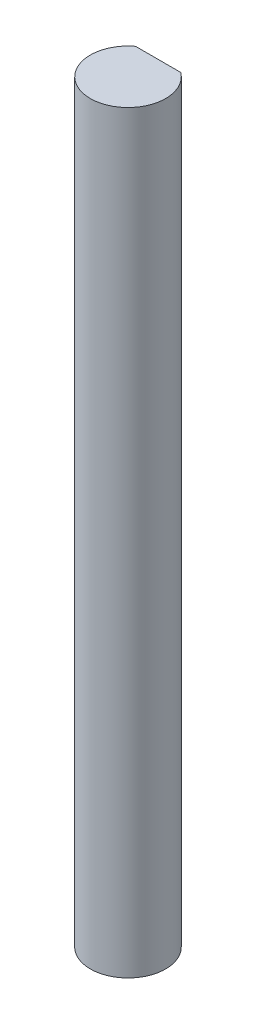
ISO-10303-21;
HEADER;
FILE_DESCRIPTION(('STEP AP214'),'2;1');
FILE_NAME('part.step','',(''),(''),'','','');
FILE_SCHEMA(('AUTOMOTIVE_DESIGN { 1 0 10303 214 1 1 1 1 }'));
ENDSEC;
DATA;
#1=APPLICATION_CONTEXT('core data for automotive mechanical design processes');
#2=APPLICATION_PROTOCOL_DEFINITION('international standard','automotive_design',2000,#1);
#3=PRODUCT_CONTEXT('',#1,'mechanical');
#4=PRODUCT('Part','Part','',(#3));
#5=PRODUCT_RELATED_PRODUCT_CATEGORY('part','',(#4));
#6=PRODUCT_DEFINITION_FORMATION('','',#4);
#7=PRODUCT_DEFINITION_CONTEXT('part definition',#1,'design');
#8=PRODUCT_DEFINITION('design','',#6,#7);
#9=PRODUCT_DEFINITION_SHAPE('','',#8);
#10=(LENGTH_UNIT() NAMED_UNIT(*) SI_UNIT(.MILLI.,.METRE.));
#11=(NAMED_UNIT(*) PLANE_ANGLE_UNIT() SI_UNIT($,.RADIAN.));
#12=(NAMED_UNIT(*) SI_UNIT($,.STERADIAN.) SOLID_ANGLE_UNIT());
#13=UNCERTAINTY_MEASURE_WITH_UNIT(LENGTH_MEASURE(1.E-05),#10,'distance_accuracy_value','');
#14=(GEOMETRIC_REPRESENTATION_CONTEXT(3) GLOBAL_UNCERTAINTY_ASSIGNED_CONTEXT((#13)) GLOBAL_UNIT_ASSIGNED_CONTEXT((#10,
#11,#12)) REPRESENTATION_CONTEXT('',''));
#15=CARTESIAN_POINT('',(0.,0.,0.));
#16=DIRECTION('',(0.,0.,1.));
#17=DIRECTION('',(1.,0.,0.));
#18=AXIS2_PLACEMENT_3D('',#15,#16,#17);
#19=CARTESIAN_POINT('',(0.,63.5,0.));
#20=DIRECTION('',(0.,-1.,0.));
#21=DIRECTION('',(0.,0.,-1.));
#22=AXIS2_PLACEMENT_3D('',#19,#20,#21);
#23=CYLINDRICAL_SURFACE('',#22,3.175);
#24=CARTESIAN_POINT('',(0.,0.,0.));
#25=DIRECTION('',(0.,1.,0.));
#26=DIRECTION('',(0.,0.,1.));
#27=AXIS2_PLACEMENT_3D('',#24,#25,#26);
#28=CIRCLE('',#27,3.175);
#29=CARTESIAN_POINT('',(-1.905,0.,-2.54));
#30=VERTEX_POINT('',#29);
#31=CARTESIAN_POINT('',(1.905,0.,-2.54));
#32=VERTEX_POINT('',#31);
#33=EDGE_CURVE('E64',#30,#32,#28,.T.);
#34=ORIENTED_EDGE('',*,*,#33,.T.);
#35=DIRECTION('',(0.,-1.,0.));
#36=VECTOR('',#35,1.);
#37=CARTESIAN_POINT('',(1.905,63.5,-2.54));
#38=LINE('',#37,#36);
#39=CARTESIAN_POINT('',(1.905,63.5,-2.54));
#40=VERTEX_POINT('',#39);
#41=EDGE_CURVE('E11',#40,#32,#38,.T.);
#42=ORIENTED_EDGE('',*,*,#41,.F.);
#43=CARTESIAN_POINT('',(0.,63.5,0.));
#44=DIRECTION('',(0.,1.,0.));
#45=DIRECTION('',(0.,0.,1.));
#46=AXIS2_PLACEMENT_3D('',#43,#44,#45);
#47=CIRCLE('',#46,3.175);
#48=CARTESIAN_POINT('',(-1.905,63.5,-2.54));
#49=VERTEX_POINT('',#48);
#50=EDGE_CURVE('E63',#49,#40,#47,.T.);
#51=ORIENTED_EDGE('',*,*,#50,.F.);
#52=DIRECTION('',(0.,-1.,0.));
#53=VECTOR('',#52,1.);
#54=CARTESIAN_POINT('',(-1.905,63.5,-2.54));
#55=LINE('',#54,#53);
#56=EDGE_CURVE('E41',#49,#30,#55,.T.);
#57=ORIENTED_EDGE('',*,*,#56,.T.);
#58=EDGE_LOOP('',(#34,#42,#51,#57));
#59=FACE_BOUND('',#58,.T.);
#60=ADVANCED_FACE('F33',(#59),#23,.T.);
#61=CARTESIAN_POINT('',(-1.905,63.5,-2.54));
#62=DIRECTION('',(0.,0.,1.));
#63=DIRECTION('',(1.,0.,0.));
#64=AXIS2_PLACEMENT_3D('',#61,#62,#63);
#65=PLANE('',#64);
#66=DIRECTION('',(-1.,0.,0.));
#67=VECTOR('',#66,1.);
#68=CARTESIAN_POINT('',(-1.905,0.,-2.54));
#69=LINE('',#68,#67);
#70=EDGE_CURVE('E56',#32,#30,#69,.T.);
#71=ORIENTED_EDGE('',*,*,#70,.T.);
#72=ORIENTED_EDGE('',*,*,#56,.F.);
#73=DIRECTION('',(-1.,0.,0.));
#74=VECTOR('',#73,1.);
#75=CARTESIAN_POINT('',(-1.905,63.5,-2.54));
#76=LINE('',#75,#74);
#77=EDGE_CURVE('E48',#40,#49,#76,.T.);
#78=ORIENTED_EDGE('',*,*,#77,.F.);
#79=ORIENTED_EDGE('',*,*,#41,.T.);
#80=EDGE_LOOP('',(#71,#72,#78,#79));
#81=FACE_BOUND('',#80,.T.);
#82=ADVANCED_FACE('F59',(#81),#65,.F.);
#83=CARTESIAN_POINT('',(0.,63.5,0.));
#84=DIRECTION('',(0.,1.,0.));
#85=DIRECTION('',(0.,0.,1.));
#86=AXIS2_PLACEMENT_3D('',#83,#84,#85);
#87=PLANE('',#86);
#88=ORIENTED_EDGE('',*,*,#50,.T.);
#89=ORIENTED_EDGE('',*,*,#77,.T.);
#90=EDGE_LOOP('',(#88,#89));
#91=FACE_BOUND('',#90,.T.);
#92=ADVANCED_FACE('F71',(#91),#87,.T.);
#93=CARTESIAN_POINT('',(0.,0.,0.));
#94=DIRECTION('',(0.,1.,0.));
#95=DIRECTION('',(0.,0.,1.));
#96=AXIS2_PLACEMENT_3D('',#93,#94,#95);
#97=PLANE('',#96);
#98=ORIENTED_EDGE('',*,*,#33,.F.);
#99=ORIENTED_EDGE('',*,*,#70,.F.);
#100=EDGE_LOOP('',(#98,#99));
#101=FACE_BOUND('',#100,.T.);
#102=ADVANCED_FACE('F67',(#101),#97,.F.);
#103=CLOSED_SHELL('',(#60,#82,#92,#102));
#104=MANIFOLD_SOLID_BREP('B2',#103);
#105=ADVANCED_BREP_SHAPE_REPRESENTATION('',(#18,#104),#14);
#106=SHAPE_DEFINITION_REPRESENTATION(#9,#105);
ENDSEC;
END-ISO-10303-21;
